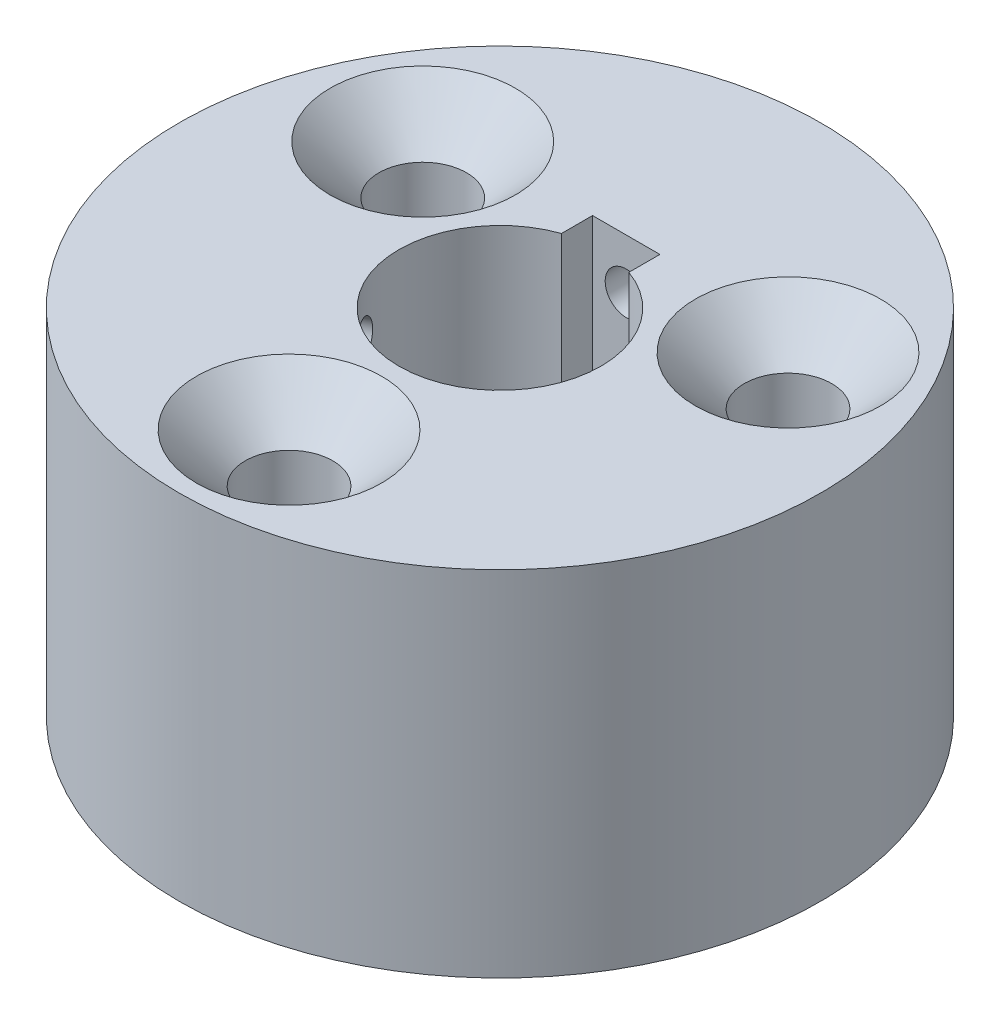
ISO-10303-21;
HEADER;
FILE_DESCRIPTION(('STEP AP214'),'2;1');
FILE_NAME('part.step','',(''),(''),'','','');
FILE_SCHEMA(('AUTOMOTIVE_DESIGN { 1 0 10303 214 1 1 1 1 }'));
ENDSEC;
DATA;
#1=APPLICATION_CONTEXT('core data for automotive mechanical design processes');
#2=APPLICATION_PROTOCOL_DEFINITION('international standard','automotive_design',2000,#1);
#3=PRODUCT_CONTEXT('',#1,'mechanical');
#4=PRODUCT('Part','Part','',(#3));
#5=PRODUCT_RELATED_PRODUCT_CATEGORY('part','',(#4));
#6=PRODUCT_DEFINITION_FORMATION('','',#4);
#7=PRODUCT_DEFINITION_CONTEXT('part definition',#1,'design');
#8=PRODUCT_DEFINITION('design','',#6,#7);
#9=PRODUCT_DEFINITION_SHAPE('','',#8);
#10=(LENGTH_UNIT() NAMED_UNIT(*) SI_UNIT(.MILLI.,.METRE.));
#11=(NAMED_UNIT(*) PLANE_ANGLE_UNIT() SI_UNIT($,.RADIAN.));
#12=(NAMED_UNIT(*) SI_UNIT($,.STERADIAN.) SOLID_ANGLE_UNIT());
#13=UNCERTAINTY_MEASURE_WITH_UNIT(LENGTH_MEASURE(1.E-05),#10,'distance_accuracy_value','');
#14=(GEOMETRIC_REPRESENTATION_CONTEXT(3) GLOBAL_UNCERTAINTY_ASSIGNED_CONTEXT((#13)) GLOBAL_UNIT_ASSIGNED_CONTEXT((#10,
#11,#12)) REPRESENTATION_CONTEXT('',''));
#15=CARTESIAN_POINT('',(0.,0.,0.));
#16=DIRECTION('',(0.,0.,1.));
#17=DIRECTION('',(1.,0.,0.));
#18=AXIS2_PLACEMENT_3D('',#15,#16,#17);
#19=CARTESIAN_POINT('',(0.,21.,0.));
#20=DIRECTION('',(0.,-1.,0.));
#21=DIRECTION('',(0.,0.,-1.));
#22=AXIS2_PLACEMENT_3D('',#19,#20,#21);
#23=CYLINDRICAL_SURFACE('',#22,19.05);
#24=CARTESIAN_POINT('',(0.,21.,0.));
#25=DIRECTION('',(0.,1.,0.));
#26=DIRECTION('',(0.,0.,1.));
#27=AXIS2_PLACEMENT_3D('',#24,#25,#26);
#28=CIRCLE('',#27,19.05);
#29=CARTESIAN_POINT('',(0.,21.,19.05));
#30=VERTEX_POINT('',#29);
#31=EDGE_CURVE('E132',#30,#30,#28,.T.);
#32=ORIENTED_EDGE('',*,*,#31,.F.);
#33=EDGE_LOOP('',(#32));
#34=FACE_BOUND('',#33,.T.);
#35=CARTESIAN_POINT('',(0.,0.,0.));
#36=DIRECTION('',(0.,1.,0.));
#37=DIRECTION('',(0.,0.,1.));
#38=AXIS2_PLACEMENT_3D('',#35,#36,#37);
#39=CIRCLE('',#38,19.05);
#40=CARTESIAN_POINT('',(0.,0.,19.05));
#41=VERTEX_POINT('',#40);
#42=EDGE_CURVE('E126',#41,#41,#39,.T.);
#43=ORIENTED_EDGE('',*,*,#42,.T.);
#44=EDGE_LOOP('',(#43));
#45=FACE_BOUND('',#44,.T.);
#46=CARTESIAN_POINT('',(0.,19.25,-19.05));
#47=CARTESIAN_POINT('',(0.0701320952346098,19.2499969169699,-19.0499994558287));
#48=CARTESIAN_POINT('',(0.140313117578772,19.2440779511875,-19.0496085756252));
#49=CARTESIAN_POINT('',(0.278736790955795,19.2205512689801,-19.0480868560759));
#50=CARTESIAN_POINT('',(0.346977097943901,19.2029299954657,-19.0469551585172));
#51=CARTESIAN_POINT('',(0.479494265307166,19.1565074564178,-19.0440798114891));
#52=CARTESIAN_POINT('',(0.543773215366953,19.1277121449073,-19.0423364879686));
#53=CARTESIAN_POINT('',(0.666568678344886,19.0597687121925,-19.0384338889284));
#54=CARTESIAN_POINT('',(0.725086495339469,19.0206229413222,-19.03627470787));
#55=CARTESIAN_POINT('',(0.834810947657195,18.9330198041102,-19.0317790904157));
#56=CARTESIAN_POINT('',(0.886006902659495,18.8845490722722,-19.0294424025436));
#57=CARTESIAN_POINT('',(0.979542975862888,18.7796996022841,-19.024857271173));
#58=CARTESIAN_POINT('',(1.02188272159533,18.7233205316968,-19.0226088313893));
#59=CARTESIAN_POINT('',(1.09653802810109,18.6041935100206,-19.0184517944391));
#60=CARTESIAN_POINT('',(1.12884462010988,18.5414399267812,-19.01654350198));
#61=CARTESIAN_POINT('',(1.18245918545529,18.4113846732281,-19.0132852476234));
#62=CARTESIAN_POINT('',(1.20376728700412,18.3440830559423,-19.0119352792174));
#63=CARTESIAN_POINT('',(1.23475011568768,18.2069458790863,-19.0099483257512));
#64=CARTESIAN_POINT('',(1.24444170456142,18.1371141442316,-19.009310307366));
#65=CARTESIAN_POINT('',(1.25196845685249,17.9968123505031,-19.008816110364));
#66=CARTESIAN_POINT('',(1.24980376612664,17.9263422994926,-19.008959922129));
#67=CARTESIAN_POINT('',(1.23369339038071,17.7868792404691,-19.0100122086172));
#68=CARTESIAN_POINT('',(1.21976596213253,17.7178841133015,-19.0109194983496));
#69=CARTESIAN_POINT('',(1.18055378376908,17.5832130912856,-19.0133946325389));
#70=CARTESIAN_POINT('',(1.15526895993291,17.5175372179858,-19.0149624812836));
#71=CARTESIAN_POINT('',(1.09403904534737,17.3913104093233,-19.0185834156036));
#72=CARTESIAN_POINT('',(1.05808568475336,17.3307634967128,-19.0206368773562));
#73=CARTESIAN_POINT('',(0.976545268854727,17.2165572948509,-19.0249972596527));
#74=CARTESIAN_POINT('',(0.930958093813246,17.1628980912187,-19.0273041833466));
#75=CARTESIAN_POINT('',(0.831341332819331,17.0638842830567,-19.0319167849973));
#76=CARTESIAN_POINT('',(0.777295948979233,17.0185455705994,-19.0342224523535));
#77=CARTESIAN_POINT('',(0.662352267409874,16.9375823656335,-19.0385685277599));
#78=CARTESIAN_POINT('',(0.601453967050361,16.9019578768534,-19.0406089357083));
#79=CARTESIAN_POINT('',(0.474523402104877,16.8414356663021,-19.0441947620993));
#80=CARTESIAN_POINT('',(0.408490843277508,16.8165385598468,-19.0457401521466));
#81=CARTESIAN_POINT('',(0.273170546193937,16.7781885346168,-19.0481614300066));
#82=CARTESIAN_POINT('',(0.203882849844194,16.7647354685549,-19.0490373264358));
#83=CARTESIAN_POINT('',(0.0641569684316555,16.7496751299669,-19.0500198098883));
#84=CARTESIAN_POINT('',(-0.00627883906493667,16.748045887984,-19.0501278236814));
#85=CARTESIAN_POINT('',(-0.146422723376131,16.7566220233295,-19.0495661676468));
#86=CARTESIAN_POINT('',(-0.216130804368444,16.7668273326806,-19.048896502286));
#87=CARTESIAN_POINT('',(-0.352778490050958,16.7987646862463,-19.0468557834139));
#88=CARTESIAN_POINT('',(-0.419720463679185,16.8204866372277,-19.0454853441011));
#89=CARTESIAN_POINT('',(-0.549008849412528,16.8748304088805,-19.0421972254532));
#90=CARTESIAN_POINT('',(-0.61135521599561,16.9074523375047,-19.0402795406983));
#91=CARTESIAN_POINT('',(-0.729783126646302,16.9827258793808,-19.0361087855208));
#92=CARTESIAN_POINT('',(-0.78585533697284,17.025392149951,-19.0338552267506));
#93=CARTESIAN_POINT('',(-0.890049256197664,17.1195219235776,-19.029267921486));
#94=CARTESIAN_POINT('',(-0.938170879010056,17.1709855218757,-19.0269341741237));
#95=CARTESIAN_POINT('',(-1.02517217142005,17.2813439454942,-19.0224453751996));
#96=CARTESIAN_POINT('',(-1.0640375771361,17.3402500286772,-19.0202906027242));
#97=CARTESIAN_POINT('',(-1.13132558967948,17.4637647850472,-19.0164072109853));
#98=CARTESIAN_POINT('',(-1.15974826622792,17.5283734201573,-19.0146785888766));
#99=CARTESIAN_POINT('',(-1.20531935751712,17.6614073883162,-19.0118444592476));
#100=CARTESIAN_POINT('',(-1.22247671748158,17.7298296462037,-19.0107384574354));
#101=CARTESIAN_POINT('',(-1.24505934409127,17.8685912397472,-19.0092729285844));
#102=CARTESIAN_POINT('',(-1.25048474139055,17.9389305540448,-19.0089133932326));
#103=CARTESIAN_POINT('',(-1.24944814896165,18.0793877708249,-19.008981545132));
#104=CARTESIAN_POINT('',(-1.24300858187951,18.1495058406106,-19.0094077474814));
#105=CARTESIAN_POINT('',(-1.21847138044502,18.2876627711114,-19.0109962009506));
#106=CARTESIAN_POINT('',(-1.20037372533375,18.3557016281239,-19.0121584533811));
#107=CARTESIAN_POINT('',(-1.1530392160457,18.4877718612911,-19.0150876673603));
#108=CARTESIAN_POINT('',(-1.12380249975853,18.5518032870421,-19.0168546214235));
#109=CARTESIAN_POINT('',(-1.05502276278925,18.6740517106168,-19.0207941030127));
#110=CARTESIAN_POINT('',(-1.01547999514387,18.7322688511459,-19.0229666205809));
#111=CARTESIAN_POINT('',(-0.927127403821067,18.8413500702223,-19.0274772201963));
#112=CARTESIAN_POINT('',(-0.878301286779971,18.8922009394043,-19.0298155887382));
#113=CARTESIAN_POINT('',(-0.772791460267281,18.9850024967133,-19.0343919130321));
#114=CARTESIAN_POINT('',(-0.716105834125229,19.0269510075201,-19.0366298441139));
#115=CARTESIAN_POINT('',(-0.596415776051894,19.1007912317706,-19.040755662544));
#116=CARTESIAN_POINT('',(-0.533403116850096,19.132669621516,-19.0426430847881));
#117=CARTESIAN_POINT('',(-0.402952884836369,19.1853548514662,-19.0458491074783));
#118=CARTESIAN_POINT('',(-0.335520585881371,19.2061746268779,-19.047168372152));
#119=CARTESIAN_POINT('',(-0.223064687474662,19.2307546642535,-19.0487446338208));
#120=CARTESIAN_POINT('',(-0.17876754218853,19.2379622990525,-19.0492132973096));
#121=CARTESIAN_POINT('',(-0.089653596712337,19.2475859487574,-19.0498411541105));
#122=CARTESIAN_POINT('',(-0.0448367973224418,19.2500019710404,-19.0500003478992));
#123=CARTESIAN_POINT('',(0.,19.25,-19.05));
#124=B_SPLINE_CURVE_WITH_KNOTS('',3,(#46,#47,#48,#49,#50,#51,#52,#53,#54,#55,#56,#57,#58,#59,
#60,#61,#62,#63,#64,#65,#66,#67,#68,#69,#70,#71,#72,#73,#74,#75,#76,#77,#78,#79,#80,#81,#82,#83,
#84,#85,#86,#87,#88,#89,#90,#91,#92,#93,#94,#95,#96,#97,#98,#99,#100,#101,#102,#103,#104,#105,
#106,#107,#108,#109,#110,#111,#112,#113,#114,#115,#116,#117,#118,#119,#120,#121,#122,#123),
.UNSPECIFIED.,.T.,.F.,(4,2,2,2,2,2,2,2,2,2,2,2,2,2,2,2,2,2,2,2,2,2,2,2,2,2,2,2,2,2,2,2,2,2,2,2,
2,2,4),(0.,0.210232601889913,0.420709183500349,0.631073767514437,0.84139062388597,
1.05201120470287,1.26264064188194,1.47345782503065,1.68427255057403,1.89478089979801,
2.10528665933866,2.31546629513759,2.52564729523315,2.73599164717547,2.94633861360153,
3.15708325210695,3.36782797149963,3.57858477746552,3.78933887090314,3.999701268625,
4.21006245803953,4.42023959003674,4.63041880367526,4.84090664592309,5.05139676710274,
5.2622091857817,5.47302019694174,5.68366361054306,5.89430467828303,6.10454808056603,
6.31479185721903,6.52503303136454,6.73526904410254,6.94587750991972,7.15653742670468,
7.36747490975436,7.5781651138738,7.71257106656193,7.84697681231892),.UNSPECIFIED.);
#125=CARTESIAN_POINT('',(0.,19.25,-19.05));
#126=VERTEX_POINT('',#125);
#127=EDGE_CURVE('E154',#126,#126,#124,.T.);
#128=ORIENTED_EDGE('',*,*,#127,.F.);
#129=EDGE_LOOP('',(#128));
#130=FACE_BOUND('',#129,.T.);
#131=CARTESIAN_POINT('',(-17.0872294966387,18.,8.42194087661514));
#132=CARTESIAN_POINT('',(-17.087228430102,17.9298680880402,8.42194382101808));
#133=CARTESIAN_POINT('',(-17.0846082228931,17.8596872483578,8.42726564214312));
#134=CARTESIAN_POINT('',(-17.074165468831,17.721263954522,8.44840263832572));
#135=CARTESIAN_POINT('',(-17.0663368877596,17.6530238445566,8.46422998462454));
#136=CARTESIAN_POINT('',(-17.0456200688498,17.5205070936957,8.50587292000309));
#137=CARTESIAN_POINT('',(-17.0327345277017,17.4562283614469,8.53168318545437));
#138=CARTESIAN_POINT('',(-17.0021466425373,17.333433263018,8.59247704887217));
#139=CARTESIAN_POINT('',(-16.9844453918056,17.2749155930364,8.62745856467358));
#140=CARTESIAN_POINT('',(-16.9445391285763,17.165190973058,8.70557375523941));
#141=CARTESIAN_POINT('',(-16.9223276206367,17.1139947503421,8.74871918107156));
#142=CARTESIAN_POINT('',(-16.8738726561291,17.0204581609221,8.84181369479193));
#143=CARTESIAN_POINT('',(-16.8476290304348,16.9781181658663,8.8917630680601));
#144=CARTESIAN_POINT('',(-16.7916621753083,16.9034625999348,8.99700679373839));
#145=CARTESIAN_POINT('',(-16.7619358809182,16.8711559516727,9.05230584661683));
#146=CARTESIAN_POINT('',(-16.6997257352408,16.8175412681103,9.16656354439498));
#147=CARTESIAN_POINT('',(-16.6672419159338,16.7962331052756,9.22552214685109));
#148=CARTESIAN_POINT('',(-16.6003908304023,16.7652501466134,9.34527782170511));
#149=CARTESIAN_POINT('',(-16.566026370799,16.755558484341,9.40607209691699));
#150=CARTESIAN_POINT('',(-16.4963026712977,16.7480315442666,9.52782339007076));
#151=CARTESIAN_POINT('',(-16.4609434435773,16.7501961213873,9.58878040601218));
#152=CARTESIAN_POINT('',(-16.3903022747763,16.7663063186755,9.70903436040843));
#153=CARTESIAN_POINT('',(-16.3550202985176,16.7802337963895,9.76833371013165));
#154=CARTESIAN_POINT('',(-16.285544543634,16.8194462836851,9.88372793199445));
#155=CARTESIAN_POINT('',(-16.251350771968,16.8447313658814,9.93982278364353));
#156=CARTESIAN_POINT('',(-16.1851053534157,16.9059618125096,10.0473309415775));
#157=CARTESIAN_POINT('',(-16.1530553794746,16.9419153860252,10.0987406027848));
#158=CARTESIAN_POINT('',(-16.0921786003835,17.0234562548103,10.1954675755771));
#159=CARTESIAN_POINT('',(-16.0633518353432,17.0690436699433,10.2407848113491));
#160=CARTESIAN_POINT('',(-16.0098503891902,17.1686605995064,10.3242267153934));
#161=CARTESIAN_POINT('',(-15.9851836361223,17.2227058632512,10.3623376664882));
#162=CARTESIAN_POINT('',(-15.9409357670081,17.3376492039403,10.4302788081617));
#163=CARTESIAN_POINT('',(-15.9213546532146,17.3985472839203,10.4601089950724));
#164=CARTESIAN_POINT('',(-15.8879840059272,17.5254777928623,10.510727279827));
#165=CARTESIAN_POINT('',(-15.8741948437306,17.5915105506651,10.531514797987));
#166=CARTESIAN_POINT('',(-15.8529191330462,17.7268312796901,10.563513969758));
#167=CARTESIAN_POINT('',(-15.8454325027911,17.7961192086685,10.5747257476019));
#168=CARTESIAN_POINT('',(-15.8370498236121,17.9358451923987,10.5872758976307));
#169=CARTESIAN_POINT('',(-15.8361415167125,18.0062808627592,10.5886326336066));
#170=CARTESIAN_POINT('',(-15.8409171414027,18.1464244436682,10.581486751473));
#171=CARTESIAN_POINT('',(-15.8466010351315,18.2161323583941,10.5729841899885));
#172=CARTESIAN_POINT('',(-15.8643404291569,18.3527792468796,10.5463479834863));
#173=CARTESIAN_POINT('',(-15.8763903105347,18.4197206064369,10.5282228317483));
#174=CARTESIAN_POINT('',(-15.9064137881726,18.5490078387088,10.4828067391565));
#175=CARTESIAN_POINT('',(-15.9243874436387,18.6113536654853,10.4555157066931));
#176=CARTESIAN_POINT('',(-15.9656392062386,18.7297812174435,10.3924146523931));
#177=CARTESIAN_POINT('',(-15.9889251137733,18.7858535484771,10.356592099614));
#178=CARTESIAN_POINT('',(-16.0399635513759,18.890047746758,10.2773675513881));
#179=CARTESIAN_POINT('',(-16.0677161295099,18.9381695284377,10.2339654743772));
#180=CARTESIAN_POINT('',(-16.1267808458528,19.0251711511835,10.1406354908599));
#181=CARTESIAN_POINT('',(-16.1580983697459,19.0640367272087,10.0906976931116));
#182=CARTESIAN_POINT('',(-16.2232150511238,19.1313250388355,9.98567003467076));
#183=CARTESIAN_POINT('',(-16.2570141920336,19.1597478441774,9.93058020838821));
#184=CARTESIAN_POINT('',(-16.3259813892095,19.2053190235402,9.81678414641603));
#185=CARTESIAN_POINT('',(-16.3611483287617,19.2224763985231,9.75808083898194));
#186=CARTESIAN_POINT('',(-16.4317954806237,19.2450591340272,9.63864146956164));
#187=CARTESIAN_POINT('',(-16.4672756894734,19.2504846239684,9.57790543000699));
#188=CARTESIAN_POINT('',(-16.5374455032932,19.2494482962725,9.45623177145531));
#189=CARTESIAN_POINT('',(-16.5721364682572,19.2430087906235,9.39529474547822));
#190=CARTESIAN_POINT('',(-16.6398425038277,19.2184715622082,9.27485396196406));
#191=CARTESIAN_POINT('',(-16.6728575715593,19.2003738194426,9.21535020688588));
#192=CARTESIAN_POINT('',(-16.7363605467936,19.1530389748097,9.09951110081254));
#193=CARTESIAN_POINT('',(-16.7668484853076,19.12380200966,9.04317571094002));
#194=CARTESIAN_POINT('',(-16.8245651621431,19.0550216446896,8.93533727451395));
#195=CARTESIAN_POINT('',(-16.8517939806036,19.0154784983654,8.88383410914667));
#196=CARTESIAN_POINT('',(-16.9024300170151,18.9271254967014,8.78711273440997));
#197=CARTESIAN_POINT('',(-16.9258304159016,18.8782994341641,8.74190576046561));
#198=CARTESIAN_POINT('',(-16.9682666364568,18.772789831772,8.65924894285506));
#199=CARTESIAN_POINT('',(-16.9873013901167,18.7161043746304,8.62180099756869));
#200=CARTESIAN_POINT('',(-17.0206448553244,18.5964144479946,8.55578882701654));
#201=CARTESIAN_POINT('',(-17.0349472836304,18.5334017210611,8.52723641551402));
#202=CARTESIAN_POINT('',(-17.0585090329933,18.4029513441594,8.48000428989182));
#203=CARTESIAN_POINT('',(-17.0677742467758,18.3355189684424,8.46131304056963));
#204=CARTESIAN_POINT('',(-17.07869641041,18.2230632628287,8.43923661112805));
#205=CARTESIAN_POINT('',(-17.0818934670265,18.1787664017233,8.43275988021084));
#206=CARTESIAN_POINT('',(-17.0861603494187,18.0896530258856,8.4241110750894));
#207=CARTESIAN_POINT('',(-17.0872301784935,18.0448365119593,8.42193899420878));
#208=CARTESIAN_POINT('',(-17.0872294966387,18.,8.42194087661514));
#209=B_SPLINE_CURVE_WITH_KNOTS('',3,(#131,#132,#133,#134,#135,#136,#137,#138,#139,#140,#141,
#142,#143,#144,#145,#146,#147,#148,#149,#150,#151,#152,#153,#154,#155,#156,#157,#158,#159,#160,
#161,#162,#163,#164,#165,#166,#167,#168,#169,#170,#171,#172,#173,#174,#175,#176,#177,#178,#179,
#180,#181,#182,#183,#184,#185,#186,#187,#188,#189,#190,#191,#192,#193,#194,#195,#196,#197,#198,
#199,#200,#201,#202,#203,#204,#205,#206,#207,#208),.UNSPECIFIED.,.T.,.F.,(4,2,2,2,2,2,2,2,2,2,2,
2,2,2,2,2,2,2,2,2,2,2,2,2,2,2,2,2,2,2,2,2,2,2,2,2,2,2,4),(0.,0.210232051446696,
0.420708094664937,0.631072050949778,0.841388289230805,1.05200959018416,1.26263972800979,
1.47345664549694,1.68427111837635,1.89477912937547,2.10528456453061,2.3154659192903,
2.52564861786045,2.73599346696012,2.9463409333059,3.15708485222147,3.36782886448873,
3.57858638459415,3.78934117035296,3.99970313667048,4.21006389482004,4.42023928816312,
4.630416782195,4.84090490593407,5.05139529490097,5.26220800819298,5.47301931358383,
5.6836619772987,5.89430231730019,6.10454695475901,6.31479195288399,6.52503437063917,
6.73527161764269,6.94587934928495,7.15653854904147,7.36747633496242,7.57816682391924,
7.71257192204244,7.84697681170705),.UNSPECIFIED.);
#210=CARTESIAN_POINT('',(-17.0872294966387,18.,8.42194087661514));
#211=VERTEX_POINT('',#210);
#212=EDGE_CURVE('E162',#211,#211,#209,.T.);
#213=ORIENTED_EDGE('',*,*,#212,.F.);
#214=EDGE_LOOP('',(#213));
#215=FACE_BOUND('',#214,.T.);
#216=ADVANCED_FACE('F51',(#34,#45,#130,#215),#23,.T.);
#217=CARTESIAN_POINT('',(0.,21.,0.));
#218=DIRECTION('',(0.,-1.,0.));
#219=DIRECTION('',(0.,0.,-1.));
#220=AXIS2_PLACEMENT_3D('',#217,#218,#219);
#221=CYLINDRICAL_SURFACE('',#220,6.);
#222=CARTESIAN_POINT('',(0.,0.,0.));
#223=DIRECTION('',(0.,1.,0.));
#224=DIRECTION('',(0.,0.,1.));
#225=AXIS2_PLACEMENT_3D('',#222,#223,#224);
#226=CIRCLE('',#225,6.);
#227=CARTESIAN_POINT('',(-2.,0.,-5.65685424949238));
#228=VERTEX_POINT('',#227);
#229=CARTESIAN_POINT('',(2.,0.,-5.65685424949238));
#230=VERTEX_POINT('',#229);
#231=EDGE_CURVE('E136',#228,#230,#226,.T.);
#232=ORIENTED_EDGE('',*,*,#231,.F.);
#233=DIRECTION('',(0.,-1.,0.));
#234=VECTOR('',#233,1.);
#235=CARTESIAN_POINT('',(-2.,21.,-5.65685424949238));
#236=LINE('',#235,#234);
#237=CARTESIAN_POINT('',(-2.,21.,-5.65685424949238));
#238=VERTEX_POINT('',#237);
#239=EDGE_CURVE('E11',#238,#228,#236,.T.);
#240=ORIENTED_EDGE('',*,*,#239,.F.);
#241=CARTESIAN_POINT('',(0.,21.,0.));
#242=DIRECTION('',(0.,1.,0.));
#243=DIRECTION('',(0.,0.,1.));
#244=AXIS2_PLACEMENT_3D('',#241,#242,#243);
#245=CIRCLE('',#244,6.);
#246=CARTESIAN_POINT('',(2.,21.,-5.65685424949238));
#247=VERTEX_POINT('',#246);
#248=EDGE_CURVE('E121',#238,#247,#245,.T.);
#249=ORIENTED_EDGE('',*,*,#248,.T.);
#250=DIRECTION('',(0.,-1.,0.));
#251=VECTOR('',#250,1.);
#252=CARTESIAN_POINT('',(2.,21.,-5.65685424949238));
#253=LINE('',#252,#251);
#254=EDGE_CURVE('E98',#247,#230,#253,.T.);
#255=ORIENTED_EDGE('',*,*,#254,.T.);
#256=EDGE_LOOP('',(#232,#240,#249,#255));
#257=FACE_BOUND('',#256,.T.);
#258=CARTESIAN_POINT('',(-5.70713783756403,18.,1.85164189384581));
#259=CARTESIAN_POINT('',(-5.70713780004336,17.930609384849,1.85164474880094));
#260=CARTESIAN_POINT('',(-5.70531646071246,17.8611880279848,1.85728493527783));
#261=CARTESIAN_POINT('',(-5.69799533361061,17.7243136826827,1.879622892532));
#262=CARTESIAN_POINT('',(-5.6924927261253,17.6568622444936,1.89632913940246));
#263=CARTESIAN_POINT('',(-5.67772267928026,17.5259276271651,1.94010170743909));
#264=CARTESIAN_POINT('',(-5.66845915141676,17.4624404040082,1.96715726325631));
#265=CARTESIAN_POINT('',(-5.64604204458464,17.3410755003544,2.03059994382416));
#266=CARTESIAN_POINT('',(-5.63288862283479,17.28319759327,2.06698669142591));
#267=CARTESIAN_POINT('',(-5.60235819594923,17.1738046248465,2.14836965564537));
#268=CARTESIAN_POINT('',(-5.58492554938409,17.1223881063735,2.193477479438));
#269=CARTESIAN_POINT('',(-5.54586370818434,17.0282389313519,2.29044162162389));
#270=CARTESIAN_POINT('',(-5.5242342059872,16.9855069117086,2.34229843451854));
#271=CARTESIAN_POINT('',(-5.47661070372346,16.9095541119171,2.45159471025239));
#272=CARTESIAN_POINT('',(-5.45057722040209,16.8764274735367,2.50908249631087));
#273=CARTESIAN_POINT('',(-5.39456233793636,16.8212339471402,2.62735089296272));
#274=CARTESIAN_POINT('',(-5.36458134050837,16.7991659348465,2.68813116812799));
#275=CARTESIAN_POINT('',(-5.30166459323958,16.7670242388825,2.81015935766364));
#276=CARTESIAN_POINT('',(-5.268777081691,16.7567839828048,2.87138823995524));
#277=CARTESIAN_POINT('',(-5.20049573226462,16.748068304243,2.99327941878482));
#278=CARTESIAN_POINT('',(-5.16510215593888,16.7495916558069,3.05394177370411));
#279=CARTESIAN_POINT('',(-5.09343139364266,16.7642346009567,3.17201120315478));
#280=CARTESIAN_POINT('',(-5.05717629948893,16.7771747189581,3.2294540855837));
#281=CARTESIAN_POINT('',(-4.98446882146389,16.8139986253313,3.34058117045927));
#282=CARTESIAN_POINT('',(-4.94801642930134,16.8378828772031,3.39426521360262));
#283=CARTESIAN_POINT('',(-4.87598753360541,16.8960800521255,3.49695720120144));
#284=CARTESIAN_POINT('',(-4.84041860504089,16.9304622942097,3.54593112867443));
#285=CARTESIAN_POINT('',(-4.77179348095363,17.0086280028404,3.63775725656613));
#286=CARTESIAN_POINT('',(-4.73873759852208,17.0524126382061,3.68060869478933));
#287=CARTESIAN_POINT('',(-4.67591525455347,17.149121624891,3.76011121189254));
#288=CARTESIAN_POINT('',(-4.64622276092679,17.2022030599819,3.79662981431037));
#289=CARTESIAN_POINT('',(-4.59222641316149,17.3154820489948,3.86176798552443));
#290=CARTESIAN_POINT('',(-4.56792267905839,17.3756797613872,3.89038737836794));
#291=CARTESIAN_POINT('',(-4.52585508671967,17.5017122548288,3.9392490102906));
#292=CARTESIAN_POINT('',(-4.50810760324837,17.5675606506934,3.95947028982877));
#293=CARTESIAN_POINT('',(-4.48019364314777,17.7028916193694,3.99102911052816));
#294=CARTESIAN_POINT('',(-4.47002608624264,17.7723736728081,4.00236791761313));
#295=CARTESIAN_POINT('',(-4.45795914836413,17.9116197063189,4.01580392174948));
#296=CARTESIAN_POINT('',(-4.45590999307883,17.981354584537,4.01806853530307));
#297=CARTESIAN_POINT('',(-4.45978143640283,18.1203258115401,4.01377100187186));
#298=CARTESIAN_POINT('',(-4.46570154192922,18.1895621909023,4.00720940099238));
#299=CARTESIAN_POINT('',(-4.48507620606484,18.3248205160581,3.98551089980077));
#300=CARTESIAN_POINT('',(-4.49845062061258,18.3908686671788,3.97046519541922));
#301=CARTESIAN_POINT('',(-4.53197560786409,18.5187239894416,3.93215475857894));
#302=CARTESIAN_POINT('',(-4.55212677870242,18.5805307856504,3.90888930061371));
#303=CARTESIAN_POINT('',(-4.59854312067646,18.6991064412162,3.85417971293586));
#304=CARTESIAN_POINT('',(-4.62489030754915,18.7557922044662,3.8226251408585));
#305=CARTESIAN_POINT('',(-4.68230962183288,18.8616432491551,3.75207151809499));
#306=CARTESIAN_POINT('',(-4.7133822789523,18.9108076862392,3.71307163269047));
#307=CARTESIAN_POINT('',(-4.77945504660062,19.0010627130972,3.62763951313098));
#308=CARTESIAN_POINT('',(-4.81451227675592,19.0420040950264,3.58109361739283));
#309=CARTESIAN_POINT('',(-4.88664118282922,19.113588752088,3.48202336842944));
#310=CARTESIAN_POINT('',(-4.92371276965576,19.1442324822374,3.42949927949691));
#311=CARTESIAN_POINT('',(-4.99817531722513,19.1941386793173,3.32002937084296));
#312=CARTESIAN_POINT('',(-5.03556296898859,19.2134691655443,3.26311235572932));
#313=CARTESIAN_POINT('',(-5.10950987334847,19.2404144040081,3.14606052579015));
#314=CARTESIAN_POINT('',(-5.14606923402339,19.2480306935327,3.08592613426221));
#315=CARTESIAN_POINT('',(-5.21648779492356,19.2512676220485,2.96530626326827));
#316=CARTESIAN_POINT('',(-5.25038492844485,19.2471118999947,2.90484881973585));
#317=CARTESIAN_POINT('',(-5.31531842888389,19.2274193613471,2.78425590465538));
#318=CARTESIAN_POINT('',(-5.3463548382338,19.2118827135932,2.72412042834415));
#319=CARTESIAN_POINT('',(-5.40484277829976,19.1699722053514,2.60614690261396));
#320=CARTESIAN_POINT('',(-5.43230364221676,19.1436273361469,2.54830315769023));
#321=CARTESIAN_POINT('',(-5.48336150719398,19.080877602268,2.43649918022665));
#322=CARTESIAN_POINT('',(-5.50695817153765,19.0444718616569,2.3825392863451));
#323=CARTESIAN_POINT('',(-5.55050405282905,18.9618903320067,2.27927690861084));
#324=CARTESIAN_POINT('',(-5.57038273657852,18.9155557119433,2.23007168869845));
#325=CARTESIAN_POINT('',(-5.60598140766497,18.8147554990029,2.13901111186477));
#326=CARTESIAN_POINT('',(-5.62170040229301,18.7602879700516,2.09715751020547));
#327=CARTESIAN_POINT('',(-5.64923802485038,18.6439908975666,2.02181654977563));
#328=CARTESIAN_POINT('',(-5.66100810356442,18.5820815885379,1.9884344766183));
#329=CARTESIAN_POINT('',(-5.68052001628663,18.4531748439167,1.93199151154081));
#330=CARTESIAN_POINT('',(-5.68826539970559,18.386181951547,1.90892152782584));
#331=CARTESIAN_POINT('',(-5.69843727419575,18.2658937184316,1.87829720545258));
#332=CARTESIAN_POINT('',(-5.70170251228722,18.2132704634069,1.86832483090719));
#333=CARTESIAN_POINT('',(-5.70605276456623,18.107104219479,1.85499620643798));
#334=CARTESIAN_POINT('',(-5.70713786652552,18.05356126769,1.85163969016142));
#335=CARTESIAN_POINT('',(-5.70713783756403,18.,1.85164189384581));
#336=B_SPLINE_CURVE_WITH_KNOTS('',3,(#258,#259,#260,#261,#262,#263,#264,#265,#266,#267,#268,
#269,#270,#271,#272,#273,#274,#275,#276,#277,#278,#279,#280,#281,#282,#283,#284,#285,#286,#287,
#288,#289,#290,#291,#292,#293,#294,#295,#296,#297,#298,#299,#300,#301,#302,#303,#304,#305,#306,
#307,#308,#309,#310,#311,#312,#313,#314,#315,#316,#317,#318,#319,#320,#321,#322,#323,#324,#325,
#326,#327,#328,#329,#330,#331,#332,#333,#334,#335),.UNSPECIFIED.,.T.,.F.,(4,2,2,2,2,2,2,2,2,2,2,
2,2,2,2,2,2,2,2,2,2,2,2,2,2,2,2,2,2,2,2,2,2,2,2,2,2,2,4),(0.,0.207975654071273,0.41611079241747,
0.624030014802731,0.831940834815793,1.04271333467885,1.25350128663873,1.46629026266844,
1.67905760106933,1.88879048859265,2.09850151896339,2.30497341416461,2.51145405455871,
2.7193287197795,2.9272292410426,3.13905862244913,3.35089272191628,3.56325237332488,
3.77558175387597,3.98397516009793,4.19235567296524,4.39853786231923,4.60473825464031,
4.81383917934651,5.02296356082186,5.23559458753344,5.44821621759041,5.65954599648535,
5.87084803959582,6.07816293922645,6.28547476332982,6.49223410585102,6.69901145528174,
6.90938318978574,7.11980508427536,7.33272651358124,7.5454598457199,7.70599867585771,
7.86653104261162),.UNSPECIFIED.);
#337=CARTESIAN_POINT('',(-5.70713783756403,18.,1.85164189384581));
#338=VERTEX_POINT('',#337);
#339=EDGE_CURVE('E56',#338,#338,#336,.T.);
#340=ORIENTED_EDGE('',*,*,#339,.T.);
#341=EDGE_LOOP('',(#340));
#342=FACE_BOUND('',#341,.T.);
#343=ADVANCED_FACE('F53',(#257,#342),#221,.F.);
#344=CARTESIAN_POINT('',(-2.,21.,0.));
#345=DIRECTION('',(1.,0.,0.));
#346=DIRECTION('',(0.,0.,-1.));
#347=AXIS2_PLACEMENT_3D('',#344,#345,#346);
#348=PLANE('',#347);
#349=DIRECTION('',(0.,0.,1.));
#350=VECTOR('',#349,1.);
#351=CARTESIAN_POINT('',(-2.,0.,0.));
#352=LINE('',#351,#350);
#353=CARTESIAN_POINT('',(-2.,0.,-7.5));
#354=VERTEX_POINT('',#353);
#355=EDGE_CURVE('E111',#354,#228,#352,.T.);
#356=ORIENTED_EDGE('',*,*,#355,.F.);
#357=DIRECTION('',(0.,-1.,0.));
#358=VECTOR('',#357,1.);
#359=CARTESIAN_POINT('',(-2.,21.,-7.5));
#360=LINE('',#359,#358);
#361=CARTESIAN_POINT('',(-2.,21.,-7.5));
#362=VERTEX_POINT('',#361);
#363=EDGE_CURVE('E67',#362,#354,#360,.T.);
#364=ORIENTED_EDGE('',*,*,#363,.F.);
#365=DIRECTION('',(0.,0.,1.));
#366=VECTOR('',#365,1.);
#367=CARTESIAN_POINT('',(-2.,21.,0.));
#368=LINE('',#367,#366);
#369=EDGE_CURVE('E109',#362,#238,#368,.T.);
#370=ORIENTED_EDGE('',*,*,#369,.T.);
#371=ORIENTED_EDGE('',*,*,#239,.T.);
#372=EDGE_LOOP('',(#356,#364,#370,#371));
#373=FACE_BOUND('',#372,.T.);
#374=ADVANCED_FACE('F107',(#373),#348,.T.);
#375=CARTESIAN_POINT('',(0.,21.,-7.5));
#376=DIRECTION('',(0.,0.,-1.));
#377=DIRECTION('',(-1.,0.,0.));
#378=AXIS2_PLACEMENT_3D('',#375,#376,#377);
#379=PLANE('',#378);
#380=CARTESIAN_POINT('',(0.,18.,-7.5));
#381=DIRECTION('',(0.,0.,-1.));
#382=DIRECTION('',(-1.,0.,0.));
#383=AXIS2_PLACEMENT_3D('',#380,#381,#382);
#384=CIRCLE('',#383,1.25);
#385=CARTESIAN_POINT('',(-1.25,18.,-7.5));
#386=VERTEX_POINT('',#385);
#387=EDGE_CURVE('E140',#386,#386,#384,.F.);
#388=ORIENTED_EDGE('',*,*,#387,.F.);
#389=EDGE_LOOP('',(#388));
#390=FACE_BOUND('',#389,.T.);
#391=DIRECTION('',(1.,0.,0.));
#392=VECTOR('',#391,1.);
#393=CARTESIAN_POINT('',(0.,0.,-7.5));
#394=LINE('',#393,#392);
#395=CARTESIAN_POINT('',(2.,0.,-7.5));
#396=VERTEX_POINT('',#395);
#397=EDGE_CURVE('E91',#354,#396,#394,.T.);
#398=ORIENTED_EDGE('',*,*,#397,.T.);
#399=DIRECTION('',(0.,-1.,0.));
#400=VECTOR('',#399,1.);
#401=CARTESIAN_POINT('',(2.,21.,-7.5));
#402=LINE('',#401,#400);
#403=CARTESIAN_POINT('',(2.,21.,-7.5));
#404=VERTEX_POINT('',#403);
#405=EDGE_CURVE('E113',#404,#396,#402,.T.);
#406=ORIENTED_EDGE('',*,*,#405,.F.);
#407=DIRECTION('',(1.,0.,0.));
#408=VECTOR('',#407,1.);
#409=CARTESIAN_POINT('',(0.,21.,-7.5));
#410=LINE('',#409,#408);
#411=EDGE_CURVE('E115',#362,#404,#410,.T.);
#412=ORIENTED_EDGE('',*,*,#411,.F.);
#413=ORIENTED_EDGE('',*,*,#363,.T.);
#414=EDGE_LOOP('',(#398,#406,#412,#413));
#415=FACE_BOUND('',#414,.T.);
#416=ADVANCED_FACE('F116',(#390,#415),#379,.F.);
#417=CARTESIAN_POINT('',(2.,21.,0.));
#418=DIRECTION('',(1.,0.,0.));
#419=DIRECTION('',(0.,0.,-1.));
#420=AXIS2_PLACEMENT_3D('',#417,#418,#419);
#421=PLANE('',#420);
#422=DIRECTION('',(0.,0.,1.));
#423=VECTOR('',#422,1.);
#424=CARTESIAN_POINT('',(2.,0.,0.));
#425=LINE('',#424,#423);
#426=EDGE_CURVE('E145',#396,#230,#425,.T.);
#427=ORIENTED_EDGE('',*,*,#426,.T.);
#428=ORIENTED_EDGE('',*,*,#254,.F.);
#429=DIRECTION('',(0.,0.,1.));
#430=VECTOR('',#429,1.);
#431=CARTESIAN_POINT('',(2.,21.,0.));
#432=LINE('',#431,#430);
#433=EDGE_CURVE('E76',#404,#247,#432,.T.);
#434=ORIENTED_EDGE('',*,*,#433,.F.);
#435=ORIENTED_EDGE('',*,*,#405,.T.);
#436=EDGE_LOOP('',(#427,#428,#434,#435));
#437=FACE_BOUND('',#436,.T.);
#438=ADVANCED_FACE('F176',(#437),#421,.F.);
#439=CARTESIAN_POINT('',(0.,21.,0.));
#440=DIRECTION('',(0.,1.,0.));
#441=DIRECTION('',(0.,0.,1.));
#442=AXIS2_PLACEMENT_3D('',#439,#440,#441);
#443=PLANE('',#442);
#444=CARTESIAN_POINT('',(0.,21.,12.525));
#445=DIRECTION('',(0.,1.,0.));
#446=DIRECTION('',(0.,0.,1.));
#447=AXIS2_PLACEMENT_3D('',#444,#445,#446);
#448=CIRCLE('',#447,5.5);
#449=CARTESIAN_POINT('',(0.,21.,18.025));
#450=VERTEX_POINT('',#449);
#451=EDGE_CURVE('E343',#450,#450,#448,.T.);
#452=ORIENTED_EDGE('',*,*,#451,.F.);
#453=EDGE_LOOP('',(#452));
#454=FACE_BOUND('',#453,.T.);
#455=CARTESIAN_POINT('',(-10.8469681824001,21.,-6.26250000000005));
#456=DIRECTION('',(0.,1.,0.));
#457=DIRECTION('',(0.,0.,1.));
#458=AXIS2_PLACEMENT_3D('',#455,#456,#457);
#459=CIRCLE('',#458,5.5);
#460=CARTESIAN_POINT('',(-10.8469681824001,21.,-0.762500000000053));
#461=VERTEX_POINT('',#460);
#462=EDGE_CURVE('E353',#461,#461,#459,.T.);
#463=ORIENTED_EDGE('',*,*,#462,.F.);
#464=EDGE_LOOP('',(#463));
#465=FACE_BOUND('',#464,.T.);
#466=CARTESIAN_POINT('',(10.8469681824002,21.,-6.2624999999999));
#467=DIRECTION('',(0.,1.,0.));
#468=DIRECTION('',(0.,0.,1.));
#469=AXIS2_PLACEMENT_3D('',#466,#467,#468);
#470=CIRCLE('',#469,5.5);
#471=CARTESIAN_POINT('',(10.8469681824002,21.,-0.762499999999899));
#472=VERTEX_POINT('',#471);
#473=EDGE_CURVE('E365',#472,#472,#470,.T.);
#474=ORIENTED_EDGE('',*,*,#473,.F.);
#475=EDGE_LOOP('',(#474));
#476=FACE_BOUND('',#475,.T.);
#477=ORIENTED_EDGE('',*,*,#248,.F.);
#478=ORIENTED_EDGE('',*,*,#369,.F.);
#479=ORIENTED_EDGE('',*,*,#411,.T.);
#480=ORIENTED_EDGE('',*,*,#433,.T.);
#481=EDGE_LOOP('',(#477,#478,#479,#480));
#482=FACE_BOUND('',#481,.T.);
#483=ORIENTED_EDGE('',*,*,#31,.T.);
#484=EDGE_LOOP('',(#483));
#485=FACE_BOUND('',#484,.T.);
#486=ADVANCED_FACE('F119',(#454,#465,#476,#482,#485),#443,.T.);
#487=CARTESIAN_POINT('',(0.,0.,0.));
#488=DIRECTION('',(0.,1.,0.));
#489=DIRECTION('',(0.,0.,1.));
#490=AXIS2_PLACEMENT_3D('',#487,#488,#489);
#491=PLANE('',#490);
#492=CARTESIAN_POINT('',(0.,0.,12.525));
#493=DIRECTION('',(0.,1.,0.));
#494=DIRECTION('',(0.,0.,1.));
#495=AXIS2_PLACEMENT_3D('',#492,#493,#494);
#496=CIRCLE('',#495,2.6);
#497=CARTESIAN_POINT('',(0.,0.,15.125));
#498=VERTEX_POINT('',#497);
#499=EDGE_CURVE('E348',#498,#498,#496,.T.);
#500=ORIENTED_EDGE('',*,*,#499,.T.);
#501=EDGE_LOOP('',(#500));
#502=FACE_BOUND('',#501,.T.);
#503=CARTESIAN_POINT('',(-10.8469681824001,0.,-6.26250000000005));
#504=DIRECTION('',(0.,1.,0.));
#505=DIRECTION('',(0.,0.,1.));
#506=AXIS2_PLACEMENT_3D('',#503,#504,#505);
#507=CIRCLE('',#506,2.59999999999999);
#508=CARTESIAN_POINT('',(-10.8469681824001,0.,-3.66250000000006));
#509=VERTEX_POINT('',#508);
#510=EDGE_CURVE('E361',#509,#509,#507,.T.);
#511=ORIENTED_EDGE('',*,*,#510,.T.);
#512=EDGE_LOOP('',(#511));
#513=FACE_BOUND('',#512,.T.);
#514=CARTESIAN_POINT('',(10.8469681824002,0.,-6.2624999999999));
#515=DIRECTION('',(0.,1.,0.));
#516=DIRECTION('',(0.,0.,1.));
#517=AXIS2_PLACEMENT_3D('',#514,#515,#516);
#518=CIRCLE('',#517,2.59999999999999);
#519=CARTESIAN_POINT('',(10.8469681824002,0.,-3.66249999999991));
#520=VERTEX_POINT('',#519);
#521=EDGE_CURVE('E205',#520,#520,#518,.T.);
#522=ORIENTED_EDGE('',*,*,#521,.T.);
#523=EDGE_LOOP('',(#522));
#524=FACE_BOUND('',#523,.T.);
#525=ORIENTED_EDGE('',*,*,#231,.T.);
#526=ORIENTED_EDGE('',*,*,#426,.F.);
#527=ORIENTED_EDGE('',*,*,#397,.F.);
#528=ORIENTED_EDGE('',*,*,#355,.T.);
#529=EDGE_LOOP('',(#525,#526,#527,#528));
#530=FACE_BOUND('',#529,.T.);
#531=ORIENTED_EDGE('',*,*,#42,.F.);
#532=EDGE_LOOP('',(#531));
#533=FACE_BOUND('',#532,.T.);
#534=ADVANCED_FACE('F171',(#502,#513,#524,#530,#533),#491,.F.);
#535=CARTESIAN_POINT('',(0.,18.,-4.5));
#536=DIRECTION('',(0.,0.,-1.));
#537=DIRECTION('',(-1.,0.,0.));
#538=AXIS2_PLACEMENT_3D('',#535,#536,#537);
#539=CYLINDRICAL_SURFACE('',#538,1.25);
#540=ORIENTED_EDGE('',*,*,#127,.T.);
#541=EDGE_LOOP('',(#540));
#542=FACE_BOUND('',#541,.T.);
#543=ORIENTED_EDGE('',*,*,#387,.T.);
#544=EDGE_LOOP('',(#543));
#545=FACE_BOUND('',#544,.T.);
#546=ADVANCED_FACE('F166',(#542,#545),#539,.F.);
#547=CARTESIAN_POINT('',(-17.3205080756888,18.,9.99999999999996));
#548=DIRECTION('',(0.86602540378444,0.,-0.499999999999998));
#549=DIRECTION('',(-0.499999999999998,0.,-0.86602540378444));
#550=AXIS2_PLACEMENT_3D('',#547,#548,#549);
#551=CYLINDRICAL_SURFACE('',#550,1.25);
#552=ORIENTED_EDGE('',*,*,#339,.F.);
#553=EDGE_LOOP('',(#552));
#554=FACE_BOUND('',#553,.T.);
#555=ORIENTED_EDGE('',*,*,#212,.T.);
#556=EDGE_LOOP('',(#555));
#557=FACE_BOUND('',#556,.T.);
#558=ADVANCED_FACE('F170',(#554,#557),#551,.F.);
#559=CARTESIAN_POINT('',(10.8469681824002,21.,-6.2624999999999));
#560=DIRECTION('',(0.,1.,0.));
#561=DIRECTION('',(0.,0.,1.));
#562=AXIS2_PLACEMENT_3D('',#559,#560,#561);
#563=CYLINDRICAL_SURFACE('',#562,2.6);
#564=ORIENTED_EDGE('',*,*,#521,.F.);
#565=EDGE_LOOP('',(#564));
#566=FACE_BOUND('',#565,.T.);
#567=CARTESIAN_POINT('',(10.8469681824002,18.1,-6.2624999999999));
#568=DIRECTION('',(0.,1.,0.));
#569=DIRECTION('',(0.,0.,1.));
#570=AXIS2_PLACEMENT_3D('',#567,#568,#569);
#571=CIRCLE('',#570,2.6);
#572=CARTESIAN_POINT('',(10.8469681824002,18.1,-3.6624999999999));
#573=VERTEX_POINT('',#572);
#574=EDGE_CURVE('E368',#573,#573,#571,.T.);
#575=ORIENTED_EDGE('',*,*,#574,.T.);
#576=EDGE_LOOP('',(#575));
#577=FACE_BOUND('',#576,.T.);
#578=ADVANCED_FACE('F276',(#566,#577),#563,.F.);
#579=CARTESIAN_POINT('',(10.8469681824002,21.,-6.2624999999999));
#580=DIRECTION('',(0.,1.,0.));
#581=DIRECTION('',(0.,0.,1.));
#582=AXIS2_PLACEMENT_3D('',#579,#580,#581);
#583=CONICAL_SURFACE('',#582,5.5,0.785398163397448);
#584=ORIENTED_EDGE('',*,*,#574,.F.);
#585=EDGE_LOOP('',(#584));
#586=FACE_BOUND('',#585,.T.);
#587=ORIENTED_EDGE('',*,*,#473,.T.);
#588=EDGE_LOOP('',(#587));
#589=FACE_BOUND('',#588,.T.);
#590=ADVANCED_FACE('F285',(#586,#589),#583,.F.);
#591=CARTESIAN_POINT('',(-10.8469681824001,21.,-6.26250000000005));
#592=DIRECTION('',(0.,1.,0.));
#593=DIRECTION('',(0.,0.,1.));
#594=AXIS2_PLACEMENT_3D('',#591,#592,#593);
#595=CYLINDRICAL_SURFACE('',#594,2.6);
#596=ORIENTED_EDGE('',*,*,#510,.F.);
#597=EDGE_LOOP('',(#596));
#598=FACE_BOUND('',#597,.T.);
#599=CARTESIAN_POINT('',(-10.8469681824001,18.1,-6.26250000000005));
#600=DIRECTION('',(0.,1.,0.));
#601=DIRECTION('',(0.,0.,1.));
#602=AXIS2_PLACEMENT_3D('',#599,#600,#601);
#603=CIRCLE('',#602,2.6);
#604=CARTESIAN_POINT('',(-10.8469681824001,18.1,-3.66250000000005));
#605=VERTEX_POINT('',#604);
#606=EDGE_CURVE('E357',#605,#605,#603,.T.);
#607=ORIENTED_EDGE('',*,*,#606,.T.);
#608=EDGE_LOOP('',(#607));
#609=FACE_BOUND('',#608,.T.);
#610=ADVANCED_FACE('F294',(#598,#609),#595,.F.);
#611=CARTESIAN_POINT('',(-10.8469681824001,21.,-6.26250000000005));
#612=DIRECTION('',(0.,1.,0.));
#613=DIRECTION('',(0.,0.,1.));
#614=AXIS2_PLACEMENT_3D('',#611,#612,#613);
#615=CONICAL_SURFACE('',#614,5.5,0.785398163397448);
#616=ORIENTED_EDGE('',*,*,#606,.F.);
#617=EDGE_LOOP('',(#616));
#618=FACE_BOUND('',#617,.T.);
#619=ORIENTED_EDGE('',*,*,#462,.T.);
#620=EDGE_LOOP('',(#619));
#621=FACE_BOUND('',#620,.T.);
#622=ADVANCED_FACE('F304',(#618,#621),#615,.F.);
#623=CARTESIAN_POINT('',(0.,21.,12.525));
#624=DIRECTION('',(0.,1.,0.));
#625=DIRECTION('',(0.,0.,1.));
#626=AXIS2_PLACEMENT_3D('',#623,#624,#625);
#627=CYLINDRICAL_SURFACE('',#626,2.6);
#628=ORIENTED_EDGE('',*,*,#499,.F.);
#629=EDGE_LOOP('',(#628));
#630=FACE_BOUND('',#629,.T.);
#631=CARTESIAN_POINT('',(0.,18.1,12.525));
#632=DIRECTION('',(0.,1.,0.));
#633=DIRECTION('',(0.,0.,1.));
#634=AXIS2_PLACEMENT_3D('',#631,#632,#633);
#635=CIRCLE('',#634,2.6);
#636=CARTESIAN_POINT('',(0.,18.1,15.125));
#637=VERTEX_POINT('',#636);
#638=EDGE_CURVE('E340',#637,#637,#635,.T.);
#639=ORIENTED_EDGE('',*,*,#638,.T.);
#640=EDGE_LOOP('',(#639));
#641=FACE_BOUND('',#640,.T.);
#642=ADVANCED_FACE('F314',(#630,#641),#627,.F.);
#643=CARTESIAN_POINT('',(0.,21.,12.525));
#644=DIRECTION('',(0.,1.,0.));
#645=DIRECTION('',(0.,0.,1.));
#646=AXIS2_PLACEMENT_3D('',#643,#644,#645);
#647=CONICAL_SURFACE('',#646,5.5,0.785398163397448);
#648=ORIENTED_EDGE('',*,*,#638,.F.);
#649=EDGE_LOOP('',(#648));
#650=FACE_BOUND('',#649,.T.);
#651=ORIENTED_EDGE('',*,*,#451,.T.);
#652=EDGE_LOOP('',(#651));
#653=FACE_BOUND('',#652,.T.);
#654=ADVANCED_FACE('F324',(#650,#653),#647,.F.);
#655=CLOSED_SHELL('',(#216,#343,#374,#416,#438,#486,#534,#546,#558,#578,#590,#610,#622,#642,#654));
#656=MANIFOLD_SOLID_BREP('B2',#655);
#657=ADVANCED_BREP_SHAPE_REPRESENTATION('',(#18,#656),#14);
#658=SHAPE_DEFINITION_REPRESENTATION(#9,#657);
ENDSEC;
END-ISO-10303-21;
